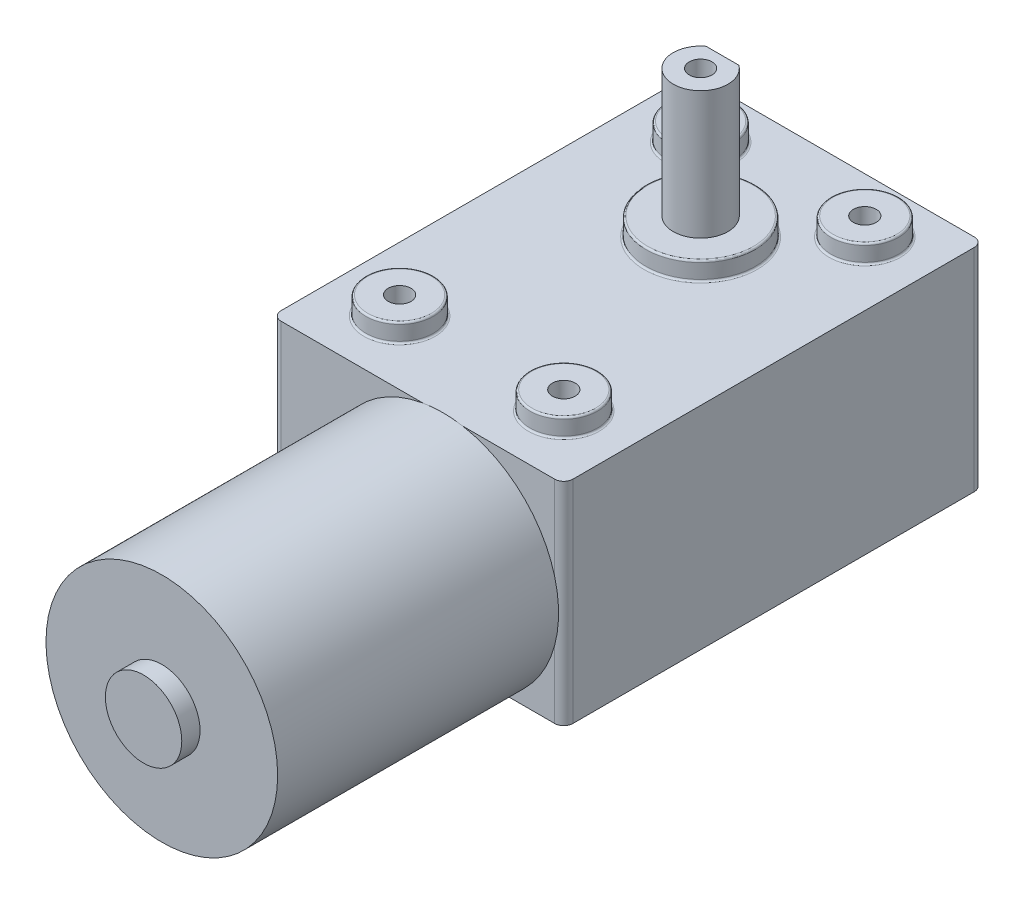
ISO-10303-21;
HEADER;
FILE_DESCRIPTION(('STEP AP214'),'2;1');
FILE_NAME('part.step','',(''),(''),'','','');
FILE_SCHEMA(('AUTOMOTIVE_DESIGN { 1 0 10303 214 1 1 1 1 }'));
ENDSEC;
DATA;
#1=APPLICATION_CONTEXT('core data for automotive mechanical design processes');
#2=APPLICATION_PROTOCOL_DEFINITION('international standard','automotive_design',2000,#1);
#3=PRODUCT_CONTEXT('',#1,'mechanical');
#4=PRODUCT('Part','Part','',(#3));
#5=PRODUCT_RELATED_PRODUCT_CATEGORY('part','',(#4));
#6=PRODUCT_DEFINITION_FORMATION('','',#4);
#7=PRODUCT_DEFINITION_CONTEXT('part definition',#1,'design');
#8=PRODUCT_DEFINITION('design','',#6,#7);
#9=PRODUCT_DEFINITION_SHAPE('','',#8);
#10=(LENGTH_UNIT() NAMED_UNIT(*) SI_UNIT(.MILLI.,.METRE.));
#11=(NAMED_UNIT(*) PLANE_ANGLE_UNIT() SI_UNIT($,.RADIAN.));
#12=(NAMED_UNIT(*) SI_UNIT($,.STERADIAN.) SOLID_ANGLE_UNIT());
#13=UNCERTAINTY_MEASURE_WITH_UNIT(LENGTH_MEASURE(1.E-05),#10,'distance_accuracy_value','');
#14=(GEOMETRIC_REPRESENTATION_CONTEXT(3) GLOBAL_UNCERTAINTY_ASSIGNED_CONTEXT((#13)) GLOBAL_UNIT_ASSIGNED_CONTEXT((#10,
#11,#12)) REPRESENTATION_CONTEXT('',''));
#15=CARTESIAN_POINT('',(0.,0.,0.));
#16=DIRECTION('',(0.,0.,1.));
#17=DIRECTION('',(1.,0.,0.));
#18=AXIS2_PLACEMENT_3D('',#15,#16,#17);
#19=CARTESIAN_POINT('',(0.,23.2,0.));
#20=DIRECTION('',(0.,0.,-1.));
#21=DIRECTION('',(-1.,0.,0.));
#22=AXIS2_PLACEMENT_3D('',#19,#20,#21);
#23=PLANE('',#22);
#24=CARTESIAN_POINT('',(18.7297984360643,10.6881933027604,0.));
#25=DIRECTION('',(0.,0.,1.));
#26=DIRECTION('',(1.,0.,0.));
#27=AXIS2_PLACEMENT_3D('',#24,#25,#26);
#28=CIRCLE('',#27,12.7);
#29=CARTESIAN_POINT('',(25.5892826676103,0.,0.));
#30=VERTEX_POINT('',#29);
#31=CARTESIAN_POINT('',(31.,7.41219672455852,0.));
#32=VERTEX_POINT('',#31);
#33=EDGE_CURVE('E176',#30,#32,#28,.T.);
#34=ORIENTED_EDGE('',*,*,#33,.F.);
#35=DIRECTION('',(1.,0.,0.));
#36=VECTOR('',#35,1.);
#37=CARTESIAN_POINT('',(0.,0.,0.));
#38=LINE('',#37,#36);
#39=CARTESIAN_POINT('',(31.,0.,0.));
#40=VERTEX_POINT('',#39);
#41=EDGE_CURVE('E252',#30,#40,#38,.T.);
#42=ORIENTED_EDGE('',*,*,#41,.T.);
#43=DIRECTION('',(0.,-1.,0.));
#44=VECTOR('',#43,1.);
#45=CARTESIAN_POINT('',(31.,23.2,0.));
#46=LINE('',#45,#44);
#47=EDGE_CURVE('E159',#40,#32,#46,.F.);
#48=ORIENTED_EDGE('',*,*,#47,.T.);
#49=EDGE_LOOP('',(#34,#42,#48));
#50=FACE_BOUND('',#49,.T.);
#51=ADVANCED_FACE('F36',(#50),#23,.F.);
#52=CARTESIAN_POINT('',(31.,13.9641898809622,0.));
#53=VERTEX_POINT('',#52);
#54=CARTESIAN_POINT('',(20.9080300975067,23.2,0.));
#55=VERTEX_POINT('',#54);
#56=EDGE_CURVE('E161',#53,#55,#28,.T.);
#57=ORIENTED_EDGE('',*,*,#56,.F.);
#58=CARTESIAN_POINT('',(31.,23.2,0.));
#59=VERTEX_POINT('',#58);
#60=EDGE_CURVE('E149',#53,#59,#46,.F.);
#61=ORIENTED_EDGE('',*,*,#60,.T.);
#62=DIRECTION('',(1.,0.,0.));
#63=VECTOR('',#62,1.);
#64=CARTESIAN_POINT('',(0.,23.2,0.));
#65=LINE('',#64,#63);
#66=EDGE_CURVE('E52',#55,#59,#65,.T.);
#67=ORIENTED_EDGE('',*,*,#66,.F.);
#68=EDGE_LOOP('',(#57,#61,#67));
#69=FACE_BOUND('',#68,.T.);
#70=ADVANCED_FACE('F162',(#69),#23,.F.);
#71=CARTESIAN_POINT('',(0.,23.2,0.));
#72=DIRECTION('',(1.,0.,0.));
#73=DIRECTION('',(0.,0.,-1.));
#74=AXIS2_PLACEMENT_3D('',#71,#72,#73);
#75=PLANE('',#74);
#76=DIRECTION('',(0.,0.,1.));
#77=VECTOR('',#76,1.);
#78=CARTESIAN_POINT('',(0.,23.2,0.));
#79=LINE('',#78,#77);
#80=CARTESIAN_POINT('',(0.,23.2,-45.));
#81=VERTEX_POINT('',#80);
#82=CARTESIAN_POINT('',(0.,23.2,-1.));
#83=VERTEX_POINT('',#82);
#84=EDGE_CURVE('E239',#81,#83,#79,.T.);
#85=ORIENTED_EDGE('',*,*,#84,.F.);
#86=DIRECTION('',(0.,-1.,0.));
#87=VECTOR('',#86,1.);
#88=CARTESIAN_POINT('',(0.,23.2,-45.));
#89=LINE('',#88,#87);
#90=CARTESIAN_POINT('',(0.,0.,-45.));
#91=VERTEX_POINT('',#90);
#92=EDGE_CURVE('E261',#81,#91,#89,.T.);
#93=ORIENTED_EDGE('',*,*,#92,.T.);
#94=DIRECTION('',(0.,0.,1.));
#95=VECTOR('',#94,1.);
#96=CARTESIAN_POINT('',(0.,0.,0.));
#97=LINE('',#96,#95);
#98=CARTESIAN_POINT('',(0.,0.,-1.));
#99=VERTEX_POINT('',#98);
#100=EDGE_CURVE('E233',#91,#99,#97,.T.);
#101=ORIENTED_EDGE('',*,*,#100,.T.);
#102=DIRECTION('',(0.,-1.,0.));
#103=VECTOR('',#102,1.);
#104=CARTESIAN_POINT('',(0.,23.2,-1.));
#105=LINE('',#104,#103);
#106=EDGE_CURVE('E237',#99,#83,#105,.F.);
#107=ORIENTED_EDGE('',*,*,#106,.T.);
#108=EDGE_LOOP('',(#85,#93,#101,#107));
#109=FACE_BOUND('',#108,.T.);
#110=ADVANCED_FACE('F393',(#109),#75,.F.);
#111=CARTESIAN_POINT('',(16.5515667746219,23.2,0.));
#112=VERTEX_POINT('',#111);
#113=CARTESIAN_POINT('',(11.8703142045183,0.,0.));
#114=VERTEX_POINT('',#113);
#115=EDGE_CURVE('E60',#112,#114,#28,.T.);
#116=ORIENTED_EDGE('',*,*,#115,.F.);
#117=CARTESIAN_POINT('',(1.,23.2,0.));
#118=VERTEX_POINT('',#117);
#119=EDGE_CURVE('E243',#118,#112,#65,.T.);
#120=ORIENTED_EDGE('',*,*,#119,.F.);
#121=DIRECTION('',(0.,-1.,0.));
#122=VECTOR('',#121,1.);
#123=CARTESIAN_POINT('',(1.,23.2,0.));
#124=LINE('',#123,#122);
#125=CARTESIAN_POINT('',(1.,0.,0.));
#126=VERTEX_POINT('',#125);
#127=EDGE_CURVE('E284',#118,#126,#124,.T.);
#128=ORIENTED_EDGE('',*,*,#127,.T.);
#129=EDGE_CURVE('E253',#126,#114,#38,.T.);
#130=ORIENTED_EDGE('',*,*,#129,.T.);
#131=EDGE_LOOP('',(#116,#120,#128,#130));
#132=FACE_BOUND('',#131,.T.);
#133=ADVANCED_FACE('F389',(#132),#23,.F.);
#134=CARTESIAN_POINT('',(32.,23.2,0.));
#135=DIRECTION('',(-1.,0.,0.));
#136=DIRECTION('',(0.,0.,1.));
#137=AXIS2_PLACEMENT_3D('',#134,#135,#136);
#138=PLANE('',#137);
#139=DIRECTION('',(0.,0.,-1.));
#140=VECTOR('',#139,1.);
#141=CARTESIAN_POINT('',(32.,0.,0.));
#142=LINE('',#141,#140);
#143=CARTESIAN_POINT('',(32.,0.,-1.));
#144=VERTEX_POINT('',#143);
#145=CARTESIAN_POINT('',(32.,0.,-45.));
#146=VERTEX_POINT('',#145);
#147=EDGE_CURVE('E255',#144,#146,#142,.T.);
#148=ORIENTED_EDGE('',*,*,#147,.T.);
#149=DIRECTION('',(0.,-1.,0.));
#150=VECTOR('',#149,1.);
#151=CARTESIAN_POINT('',(32.,23.2,-45.));
#152=LINE('',#151,#150);
#153=CARTESIAN_POINT('',(32.,23.2,-45.));
#154=VERTEX_POINT('',#153);
#155=EDGE_CURVE('E290',#146,#154,#152,.F.);
#156=ORIENTED_EDGE('',*,*,#155,.T.);
#157=DIRECTION('',(0.,0.,-1.));
#158=VECTOR('',#157,1.);
#159=CARTESIAN_POINT('',(32.,23.2,0.));
#160=LINE('',#159,#158);
#161=CARTESIAN_POINT('',(32.,23.2,-1.));
#162=VERTEX_POINT('',#161);
#163=EDGE_CURVE('E245',#162,#154,#160,.T.);
#164=ORIENTED_EDGE('',*,*,#163,.F.);
#165=DIRECTION('',(0.,-1.,0.));
#166=VECTOR('',#165,1.);
#167=CARTESIAN_POINT('',(32.,23.2,-1.));
#168=LINE('',#167,#166);
#169=EDGE_CURVE('E287',#162,#144,#168,.T.);
#170=ORIENTED_EDGE('',*,*,#169,.T.);
#171=EDGE_LOOP('',(#148,#156,#164,#170));
#172=FACE_BOUND('',#171,.T.);
#173=ADVANCED_FACE('F397',(#172),#138,.F.);
#174=CARTESIAN_POINT('',(0.,23.2,-46.));
#175=DIRECTION('',(0.,0.,1.));
#176=DIRECTION('',(1.,0.,0.));
#177=AXIS2_PLACEMENT_3D('',#174,#175,#176);
#178=PLANE('',#177);
#179=DIRECTION('',(-1.,0.,0.));
#180=VECTOR('',#179,1.);
#181=CARTESIAN_POINT('',(0.,0.,-46.));
#182=LINE('',#181,#180);
#183=CARTESIAN_POINT('',(31.,0.,-46.));
#184=VERTEX_POINT('',#183);
#185=CARTESIAN_POINT('',(1.,0.,-46.));
#186=VERTEX_POINT('',#185);
#187=EDGE_CURVE('E242',#184,#186,#182,.T.);
#188=ORIENTED_EDGE('',*,*,#187,.T.);
#189=DIRECTION('',(0.,-1.,0.));
#190=VECTOR('',#189,1.);
#191=CARTESIAN_POINT('',(1.,23.2,-46.));
#192=LINE('',#191,#190);
#193=CARTESIAN_POINT('',(1.,23.2,-46.));
#194=VERTEX_POINT('',#193);
#195=EDGE_CURVE('E276',#186,#194,#192,.F.);
#196=ORIENTED_EDGE('',*,*,#195,.T.);
#197=DIRECTION('',(-1.,0.,0.));
#198=VECTOR('',#197,1.);
#199=CARTESIAN_POINT('',(0.,23.2,-46.));
#200=LINE('',#199,#198);
#201=CARTESIAN_POINT('',(31.,23.2,-46.));
#202=VERTEX_POINT('',#201);
#203=EDGE_CURVE('E238',#202,#194,#200,.T.);
#204=ORIENTED_EDGE('',*,*,#203,.F.);
#205=DIRECTION('',(0.,-1.,0.));
#206=VECTOR('',#205,1.);
#207=CARTESIAN_POINT('',(31.,23.2,-46.));
#208=LINE('',#207,#206);
#209=EDGE_CURVE('E273',#202,#184,#208,.T.);
#210=ORIENTED_EDGE('',*,*,#209,.T.);
#211=EDGE_LOOP('',(#188,#196,#204,#210));
#212=FACE_BOUND('',#211,.T.);
#213=ADVANCED_FACE('F402',(#212),#178,.F.);
#214=CARTESIAN_POINT('',(0.,23.2,0.));
#215=DIRECTION('',(0.,-1.,0.));
#216=DIRECTION('',(0.,0.,-1.));
#217=AXIS2_PLACEMENT_3D('',#214,#215,#216);
#218=PLANE('',#217);
#219=CARTESIAN_POINT('',(16.,23.2,-31.));
#220=DIRECTION('',(0.,-1.,0.));
#221=DIRECTION('',(0.,0.,-1.));
#222=AXIS2_PLACEMENT_3D('',#219,#220,#221);
#223=CIRCLE('',#222,6.2);
#224=CARTESIAN_POINT('',(16.,23.2,-37.2));
#225=VERTEX_POINT('',#224);
#226=EDGE_CURVE('E313',#225,#225,#223,.T.);
#227=ORIENTED_EDGE('',*,*,#226,.T.);
#228=EDGE_LOOP('',(#227));
#229=FACE_BOUND('',#228,.T.);
#230=CARTESIAN_POINT('',(7.,23.2,-40.));
#231=DIRECTION('',(0.,-1.,0.));
#232=DIRECTION('',(0.,0.,-1.));
#233=AXIS2_PLACEMENT_3D('',#230,#231,#232);
#234=CIRCLE('',#233,3.9);
#235=CARTESIAN_POINT('',(7.,23.2,-43.9));
#236=VERTEX_POINT('',#235);
#237=EDGE_CURVE('E310',#236,#236,#234,.T.);
#238=ORIENTED_EDGE('',*,*,#237,.T.);
#239=EDGE_LOOP('',(#238));
#240=FACE_BOUND('',#239,.T.);
#241=CARTESIAN_POINT('',(25.,23.2,-40.));
#242=DIRECTION('',(0.,-1.,0.));
#243=DIRECTION('',(0.,0.,-1.));
#244=AXIS2_PLACEMENT_3D('',#241,#242,#243);
#245=CIRCLE('',#244,3.9);
#246=CARTESIAN_POINT('',(25.,23.2,-43.9));
#247=VERTEX_POINT('',#246);
#248=EDGE_CURVE('E307',#247,#247,#245,.T.);
#249=ORIENTED_EDGE('',*,*,#248,.T.);
#250=EDGE_LOOP('',(#249));
#251=FACE_BOUND('',#250,.T.);
#252=CARTESIAN_POINT('',(7.00000000000001,23.2,-7.));
#253=DIRECTION('',(0.,-1.,0.));
#254=DIRECTION('',(0.,0.,-1.));
#255=AXIS2_PLACEMENT_3D('',#252,#253,#254);
#256=CIRCLE('',#255,3.9);
#257=CARTESIAN_POINT('',(7.00000000000001,23.2,-10.9));
#258=VERTEX_POINT('',#257);
#259=EDGE_CURVE('E304',#258,#258,#256,.T.);
#260=ORIENTED_EDGE('',*,*,#259,.T.);
#261=EDGE_LOOP('',(#260));
#262=FACE_BOUND('',#261,.T.);
#263=CARTESIAN_POINT('',(25.,23.2,-7.));
#264=DIRECTION('',(0.,-1.,0.));
#265=DIRECTION('',(0.,0.,-1.));
#266=AXIS2_PLACEMENT_3D('',#263,#264,#265);
#267=CIRCLE('',#266,3.9);
#268=CARTESIAN_POINT('',(25.,23.2,-10.9));
#269=VERTEX_POINT('',#268);
#270=EDGE_CURVE('E301',#269,#269,#267,.T.);
#271=ORIENTED_EDGE('',*,*,#270,.T.);
#272=EDGE_LOOP('',(#271));
#273=FACE_BOUND('',#272,.T.);
#274=ORIENTED_EDGE('',*,*,#203,.T.);
#275=CARTESIAN_POINT('',(1.,23.2,-45.));
#276=DIRECTION('',(0.,-1.,0.));
#277=DIRECTION('',(0.,0.,-1.));
#278=AXIS2_PLACEMENT_3D('',#275,#276,#277);
#279=CIRCLE('',#278,1.);
#280=EDGE_CURVE('E157',#194,#81,#279,.F.);
#281=ORIENTED_EDGE('',*,*,#280,.T.);
#282=ORIENTED_EDGE('',*,*,#84,.T.);
#283=CARTESIAN_POINT('',(1.,23.2,-1.));
#284=DIRECTION('',(0.,-1.,0.));
#285=DIRECTION('',(0.,0.,-1.));
#286=AXIS2_PLACEMENT_3D('',#283,#284,#285);
#287=CIRCLE('',#286,1.);
#288=EDGE_CURVE('E281',#83,#118,#287,.F.);
#289=ORIENTED_EDGE('',*,*,#288,.T.);
#290=ORIENTED_EDGE('',*,*,#119,.T.);
#291=DIRECTION('',(-1.,0.,0.));
#292=VECTOR('',#291,1.);
#293=CARTESIAN_POINT('',(0.,23.2,0.));
#294=LINE('',#293,#292);
#295=EDGE_CURVE('E185',#55,#112,#294,.T.);
#296=ORIENTED_EDGE('',*,*,#295,.F.);
#297=ORIENTED_EDGE('',*,*,#66,.T.);
#298=CARTESIAN_POINT('',(31.,23.2,-1.));
#299=DIRECTION('',(0.,-1.,0.));
#300=DIRECTION('',(0.,0.,-1.));
#301=AXIS2_PLACEMENT_3D('',#298,#299,#300);
#302=CIRCLE('',#301,1.);
#303=EDGE_CURVE('E156',#59,#162,#302,.F.);
#304=ORIENTED_EDGE('',*,*,#303,.T.);
#305=ORIENTED_EDGE('',*,*,#163,.T.);
#306=CARTESIAN_POINT('',(31.,23.2,-45.));
#307=DIRECTION('',(0.,-1.,0.));
#308=DIRECTION('',(0.,0.,-1.));
#309=AXIS2_PLACEMENT_3D('',#306,#307,#308);
#310=CIRCLE('',#309,1.);
#311=EDGE_CURVE('E279',#154,#202,#310,.F.);
#312=ORIENTED_EDGE('',*,*,#311,.T.);
#313=EDGE_LOOP('',(#274,#281,#282,#289,#290,#296,#297,#304,#305,#312));
#314=FACE_BOUND('',#313,.T.);
#315=ADVANCED_FACE('F459',(#229,#240,#251,#262,#273,#314),#218,.F.);
#316=CARTESIAN_POINT('',(0.,0.,0.));
#317=DIRECTION('',(0.,-1.,0.));
#318=DIRECTION('',(0.,0.,-1.));
#319=AXIS2_PLACEMENT_3D('',#316,#317,#318);
#320=PLANE('',#319);
#321=ORIENTED_EDGE('',*,*,#100,.F.);
#322=CARTESIAN_POINT('',(1.,0.,-45.));
#323=DIRECTION('',(0.,-1.,0.));
#324=DIRECTION('',(0.,0.,-1.));
#325=AXIS2_PLACEMENT_3D('',#322,#323,#324);
#326=CIRCLE('',#325,1.);
#327=EDGE_CURVE('E271',#91,#186,#326,.T.);
#328=ORIENTED_EDGE('',*,*,#327,.T.);
#329=ORIENTED_EDGE('',*,*,#187,.F.);
#330=CARTESIAN_POINT('',(31.,0.,-45.));
#331=DIRECTION('',(0.,-1.,0.));
#332=DIRECTION('',(0.,0.,-1.));
#333=AXIS2_PLACEMENT_3D('',#330,#331,#332);
#334=CIRCLE('',#333,1.);
#335=EDGE_CURVE('E267',#184,#146,#334,.T.);
#336=ORIENTED_EDGE('',*,*,#335,.T.);
#337=ORIENTED_EDGE('',*,*,#147,.F.);
#338=CARTESIAN_POINT('',(31.,0.,-1.));
#339=DIRECTION('',(0.,-1.,0.));
#340=DIRECTION('',(0.,0.,-1.));
#341=AXIS2_PLACEMENT_3D('',#338,#339,#340);
#342=CIRCLE('',#341,1.);
#343=EDGE_CURVE('E264',#144,#40,#342,.T.);
#344=ORIENTED_EDGE('',*,*,#343,.T.);
#345=ORIENTED_EDGE('',*,*,#41,.F.);
#346=DIRECTION('',(-1.,0.,0.));
#347=VECTOR('',#346,1.);
#348=CARTESIAN_POINT('',(0.,0.,0.));
#349=LINE('',#348,#347);
#350=EDGE_CURVE('E183',#30,#114,#349,.T.);
#351=ORIENTED_EDGE('',*,*,#350,.T.);
#352=ORIENTED_EDGE('',*,*,#129,.F.);
#353=CARTESIAN_POINT('',(1.,0.,-1.));
#354=DIRECTION('',(0.,-1.,0.));
#355=DIRECTION('',(0.,0.,-1.));
#356=AXIS2_PLACEMENT_3D('',#353,#354,#355);
#357=CIRCLE('',#356,1.);
#358=EDGE_CURVE('E269',#126,#99,#357,.T.);
#359=ORIENTED_EDGE('',*,*,#358,.T.);
#360=EDGE_LOOP('',(#321,#328,#329,#336,#337,#344,#345,#351,#352,#359));
#361=FACE_BOUND('',#360,.T.);
#362=ADVANCED_FACE('F462',(#361),#320,.T.);
#363=CARTESIAN_POINT('',(7.,25.2,-40.));
#364=DIRECTION('',(0.,-1.,0.));
#365=DIRECTION('',(0.,0.,-1.));
#366=AXIS2_PLACEMENT_3D('',#363,#364,#365);
#367=CYLINDRICAL_SURFACE('',#366,3.7);
#368=CARTESIAN_POINT('',(7.,25.,-40.));
#369=DIRECTION('',(0.,1.,0.));
#370=DIRECTION('',(0.,0.,1.));
#371=AXIS2_PLACEMENT_3D('',#368,#369,#370);
#372=CIRCLE('',#371,3.7);
#373=CARTESIAN_POINT('',(7.,25.,-36.3));
#374=VERTEX_POINT('',#373);
#375=EDGE_CURVE('E322',#374,#374,#372,.F.);
#376=ORIENTED_EDGE('',*,*,#375,.T.);
#377=EDGE_LOOP('',(#376));
#378=FACE_BOUND('',#377,.T.);
#379=CARTESIAN_POINT('',(7.,23.4,-40.));
#380=DIRECTION('',(0.,-1.,0.));
#381=DIRECTION('',(0.,0.,-1.));
#382=AXIS2_PLACEMENT_3D('',#379,#380,#381);
#383=CIRCLE('',#382,3.7);
#384=CARTESIAN_POINT('',(7.,23.4,-43.7));
#385=VERTEX_POINT('',#384);
#386=EDGE_CURVE('E319',#385,#385,#383,.F.);
#387=ORIENTED_EDGE('',*,*,#386,.T.);
#388=EDGE_LOOP('',(#387));
#389=FACE_BOUND('',#388,.T.);
#390=ADVANCED_FACE('F497',(#378,#389),#367,.T.);
#391=CARTESIAN_POINT('',(7.,25.2,-40.));
#392=DIRECTION('',(0.,1.,0.));
#393=DIRECTION('',(0.,0.,1.));
#394=AXIS2_PLACEMENT_3D('',#391,#392,#393);
#395=PLANE('',#394);
#396=CARTESIAN_POINT('',(7.,25.2,-40.));
#397=DIRECTION('',(0.,1.,0.));
#398=DIRECTION('',(0.,0.,1.));
#399=AXIS2_PLACEMENT_3D('',#396,#397,#398);
#400=CIRCLE('',#399,3.5);
#401=CARTESIAN_POINT('',(7.,25.2,-36.5));
#402=VERTEX_POINT('',#401);
#403=EDGE_CURVE('E316',#402,#402,#400,.T.);
#404=ORIENTED_EDGE('',*,*,#403,.T.);
#405=EDGE_LOOP('',(#404));
#406=FACE_BOUND('',#405,.T.);
#407=CARTESIAN_POINT('',(7.,25.2,-40.));
#408=DIRECTION('',(0.,1.,0.));
#409=DIRECTION('',(0.,0.,1.));
#410=AXIS2_PLACEMENT_3D('',#407,#408,#409);
#411=CIRCLE('',#410,1.24999999999999);
#412=CARTESIAN_POINT('',(7.,25.2,-38.75));
#413=VERTEX_POINT('',#412);
#414=EDGE_CURVE('E200',#413,#413,#411,.T.);
#415=ORIENTED_EDGE('',*,*,#414,.F.);
#416=EDGE_LOOP('',(#415));
#417=FACE_BOUND('',#416,.T.);
#418=ADVANCED_FACE('F501',(#406,#417),#395,.T.);
#419=CARTESIAN_POINT('',(25.,25.2,-40.));
#420=DIRECTION('',(0.,-1.,0.));
#421=DIRECTION('',(0.,0.,-1.));
#422=AXIS2_PLACEMENT_3D('',#419,#420,#421);
#423=CYLINDRICAL_SURFACE('',#422,3.7);
#424=CARTESIAN_POINT('',(25.,25.,-40.));
#425=DIRECTION('',(0.,1.,0.));
#426=DIRECTION('',(0.,0.,1.));
#427=AXIS2_PLACEMENT_3D('',#424,#425,#426);
#428=CIRCLE('',#427,3.7);
#429=CARTESIAN_POINT('',(25.,25.,-36.3));
#430=VERTEX_POINT('',#429);
#431=EDGE_CURVE('E331',#430,#430,#428,.F.);
#432=ORIENTED_EDGE('',*,*,#431,.T.);
#433=EDGE_LOOP('',(#432));
#434=FACE_BOUND('',#433,.T.);
#435=CARTESIAN_POINT('',(25.,23.4,-40.));
#436=DIRECTION('',(0.,-1.,0.));
#437=DIRECTION('',(0.,0.,-1.));
#438=AXIS2_PLACEMENT_3D('',#435,#436,#437);
#439=CIRCLE('',#438,3.7);
#440=CARTESIAN_POINT('',(25.,23.4,-43.7));
#441=VERTEX_POINT('',#440);
#442=EDGE_CURVE('E328',#441,#441,#439,.F.);
#443=ORIENTED_EDGE('',*,*,#442,.T.);
#444=EDGE_LOOP('',(#443));
#445=FACE_BOUND('',#444,.T.);
#446=ADVANCED_FACE('F505',(#434,#445),#423,.T.);
#447=CARTESIAN_POINT('',(25.,25.2,-40.));
#448=DIRECTION('',(0.,1.,0.));
#449=DIRECTION('',(0.,0.,1.));
#450=AXIS2_PLACEMENT_3D('',#447,#448,#449);
#451=PLANE('',#450);
#452=CARTESIAN_POINT('',(25.,25.2,-40.));
#453=DIRECTION('',(0.,1.,0.));
#454=DIRECTION('',(0.,0.,1.));
#455=AXIS2_PLACEMENT_3D('',#452,#453,#454);
#456=CIRCLE('',#455,3.5);
#457=CARTESIAN_POINT('',(25.,25.2,-36.5));
#458=VERTEX_POINT('',#457);
#459=EDGE_CURVE('E325',#458,#458,#456,.T.);
#460=ORIENTED_EDGE('',*,*,#459,.T.);
#461=EDGE_LOOP('',(#460));
#462=FACE_BOUND('',#461,.T.);
#463=CARTESIAN_POINT('',(25.,25.2,-40.));
#464=DIRECTION('',(0.,1.,0.));
#465=DIRECTION('',(0.,0.,1.));
#466=AXIS2_PLACEMENT_3D('',#463,#464,#465);
#467=CIRCLE('',#466,1.24999999999999);
#468=CARTESIAN_POINT('',(25.,25.2,-38.75));
#469=VERTEX_POINT('',#468);
#470=EDGE_CURVE('E206',#469,#469,#467,.T.);
#471=ORIENTED_EDGE('',*,*,#470,.F.);
#472=EDGE_LOOP('',(#471));
#473=FACE_BOUND('',#472,.T.);
#474=ADVANCED_FACE('F509',(#462,#473),#451,.T.);
#475=CARTESIAN_POINT('',(7.00000000000001,25.2,-7.));
#476=DIRECTION('',(0.,-1.,0.));
#477=DIRECTION('',(0.,0.,-1.));
#478=AXIS2_PLACEMENT_3D('',#475,#476,#477);
#479=CYLINDRICAL_SURFACE('',#478,3.7);
#480=CARTESIAN_POINT('',(7.00000000000001,25.,-7.));
#481=DIRECTION('',(0.,1.,0.));
#482=DIRECTION('',(0.,0.,1.));
#483=AXIS2_PLACEMENT_3D('',#480,#481,#482);
#484=CIRCLE('',#483,3.7);
#485=CARTESIAN_POINT('',(7.00000000000001,25.,-3.3));
#486=VERTEX_POINT('',#485);
#487=EDGE_CURVE('E40',#486,#486,#484,.F.);
#488=ORIENTED_EDGE('',*,*,#487,.T.);
#489=EDGE_LOOP('',(#488));
#490=FACE_BOUND('',#489,.T.);
#491=CARTESIAN_POINT('',(7.00000000000001,23.4,-7.));
#492=DIRECTION('',(0.,-1.,0.));
#493=DIRECTION('',(0.,0.,-1.));
#494=AXIS2_PLACEMENT_3D('',#491,#492,#493);
#495=CIRCLE('',#494,3.7);
#496=CARTESIAN_POINT('',(7.00000000000001,23.4,-10.7));
#497=VERTEX_POINT('',#496);
#498=EDGE_CURVE('E345',#497,#497,#495,.F.);
#499=ORIENTED_EDGE('',*,*,#498,.T.);
#500=EDGE_LOOP('',(#499));
#501=FACE_BOUND('',#500,.T.);
#502=ADVANCED_FACE('F352',(#490,#501),#479,.T.);
#503=CARTESIAN_POINT('',(7.00000000000001,25.2,-7.));
#504=DIRECTION('',(0.,1.,0.));
#505=DIRECTION('',(0.,0.,1.));
#506=AXIS2_PLACEMENT_3D('',#503,#504,#505);
#507=PLANE('',#506);
#508=CARTESIAN_POINT('',(7.00000000000001,25.2,-7.));
#509=DIRECTION('',(0.,1.,0.));
#510=DIRECTION('',(0.,0.,1.));
#511=AXIS2_PLACEMENT_3D('',#508,#509,#510);
#512=CIRCLE('',#511,3.5);
#513=CARTESIAN_POINT('',(7.00000000000001,25.2,-3.5));
#514=VERTEX_POINT('',#513);
#515=EDGE_CURVE('E343',#514,#514,#512,.T.);
#516=ORIENTED_EDGE('',*,*,#515,.T.);
#517=EDGE_LOOP('',(#516));
#518=FACE_BOUND('',#517,.T.);
#519=CARTESIAN_POINT('',(7.00000000000001,25.2,-7.));
#520=DIRECTION('',(0.,1.,0.));
#521=DIRECTION('',(0.,0.,1.));
#522=AXIS2_PLACEMENT_3D('',#519,#520,#521);
#523=CIRCLE('',#522,1.24999999999999);
#524=CARTESIAN_POINT('',(7.00000000000001,25.2,-5.75000000000001));
#525=VERTEX_POINT('',#524);
#526=EDGE_CURVE('E194',#525,#525,#523,.T.);
#527=ORIENTED_EDGE('',*,*,#526,.F.);
#528=EDGE_LOOP('',(#527));
#529=FACE_BOUND('',#528,.T.);
#530=ADVANCED_FACE('F362',(#518,#529),#507,.T.);
#531=CARTESIAN_POINT('',(25.,25.2,-7.));
#532=DIRECTION('',(0.,-1.,0.));
#533=DIRECTION('',(0.,0.,-1.));
#534=AXIS2_PLACEMENT_3D('',#531,#532,#533);
#535=CYLINDRICAL_SURFACE('',#534,3.7);
#536=CARTESIAN_POINT('',(25.,25.,-7.));
#537=DIRECTION('',(0.,1.,0.));
#538=DIRECTION('',(0.,0.,1.));
#539=AXIS2_PLACEMENT_3D('',#536,#537,#538);
#540=CIRCLE('',#539,3.7);
#541=CARTESIAN_POINT('',(25.,25.,-3.3));
#542=VERTEX_POINT('',#541);
#543=EDGE_CURVE('E340',#542,#542,#540,.F.);
#544=ORIENTED_EDGE('',*,*,#543,.T.);
#545=EDGE_LOOP('',(#544));
#546=FACE_BOUND('',#545,.T.);
#547=CARTESIAN_POINT('',(25.,23.4,-7.));
#548=DIRECTION('',(0.,-1.,0.));
#549=DIRECTION('',(0.,0.,-1.));
#550=AXIS2_PLACEMENT_3D('',#547,#548,#549);
#551=CIRCLE('',#550,3.7);
#552=CARTESIAN_POINT('',(25.,23.4,-10.7));
#553=VERTEX_POINT('',#552);
#554=EDGE_CURVE('E337',#553,#553,#551,.F.);
#555=ORIENTED_EDGE('',*,*,#554,.T.);
#556=EDGE_LOOP('',(#555));
#557=FACE_BOUND('',#556,.T.);
#558=ADVANCED_FACE('F365',(#546,#557),#535,.T.);
#559=CARTESIAN_POINT('',(25.,25.2,-7.));
#560=DIRECTION('',(0.,1.,0.));
#561=DIRECTION('',(0.,0.,1.));
#562=AXIS2_PLACEMENT_3D('',#559,#560,#561);
#563=PLANE('',#562);
#564=CARTESIAN_POINT('',(25.,25.2,-7.));
#565=DIRECTION('',(0.,1.,0.));
#566=DIRECTION('',(0.,0.,1.));
#567=AXIS2_PLACEMENT_3D('',#564,#565,#566);
#568=CIRCLE('',#567,3.5);
#569=CARTESIAN_POINT('',(25.,25.2,-3.5));
#570=VERTEX_POINT('',#569);
#571=EDGE_CURVE('E334',#570,#570,#568,.T.);
#572=ORIENTED_EDGE('',*,*,#571,.T.);
#573=EDGE_LOOP('',(#572));
#574=FACE_BOUND('',#573,.T.);
#575=CARTESIAN_POINT('',(25.,25.2,-7.));
#576=DIRECTION('',(0.,1.,0.));
#577=DIRECTION('',(0.,0.,1.));
#578=AXIS2_PLACEMENT_3D('',#575,#576,#577);
#579=CIRCLE('',#578,1.24999999999999);
#580=CARTESIAN_POINT('',(25.,25.2,-5.75000000000001));
#581=VERTEX_POINT('',#580);
#582=EDGE_CURVE('E188',#581,#581,#579,.T.);
#583=ORIENTED_EDGE('',*,*,#582,.F.);
#584=EDGE_LOOP('',(#583));
#585=FACE_BOUND('',#584,.T.);
#586=ADVANCED_FACE('F518',(#574,#585),#563,.T.);
#587=CARTESIAN_POINT('',(16.,25.2,-31.));
#588=DIRECTION('',(0.,-1.,0.));
#589=DIRECTION('',(0.,0.,-1.));
#590=AXIS2_PLACEMENT_3D('',#587,#588,#589);
#591=CYLINDRICAL_SURFACE('',#590,6.);
#592=CARTESIAN_POINT('',(16.,25.,-31.));
#593=DIRECTION('',(0.,1.,0.));
#594=DIRECTION('',(0.,0.,1.));
#595=AXIS2_PLACEMENT_3D('',#592,#593,#594);
#596=CIRCLE('',#595,6.);
#597=CARTESIAN_POINT('',(16.,25.,-25.));
#598=VERTEX_POINT('',#597);
#599=EDGE_CURVE('E298',#598,#598,#596,.F.);
#600=ORIENTED_EDGE('',*,*,#599,.T.);
#601=EDGE_LOOP('',(#600));
#602=FACE_BOUND('',#601,.T.);
#603=CARTESIAN_POINT('',(16.,23.4,-31.));
#604=DIRECTION('',(0.,-1.,0.));
#605=DIRECTION('',(0.,0.,-1.));
#606=AXIS2_PLACEMENT_3D('',#603,#604,#605);
#607=CIRCLE('',#606,6.);
#608=CARTESIAN_POINT('',(16.,23.4,-37.));
#609=VERTEX_POINT('',#608);
#610=EDGE_CURVE('E295',#609,#609,#607,.F.);
#611=ORIENTED_EDGE('',*,*,#610,.T.);
#612=EDGE_LOOP('',(#611));
#613=FACE_BOUND('',#612,.T.);
#614=ADVANCED_FACE('F522',(#602,#613),#591,.T.);
#615=CARTESIAN_POINT('',(16.,25.2,-31.));
#616=DIRECTION('',(0.,1.,0.));
#617=DIRECTION('',(0.,0.,1.));
#618=AXIS2_PLACEMENT_3D('',#615,#616,#617);
#619=PLANE('',#618);
#620=CARTESIAN_POINT('',(16.,25.2,-31.));
#621=DIRECTION('',(0.,1.,0.));
#622=DIRECTION('',(0.,0.,1.));
#623=AXIS2_PLACEMENT_3D('',#620,#621,#622);
#624=CIRCLE('',#623,5.8);
#625=CARTESIAN_POINT('',(16.,25.2,-25.2));
#626=VERTEX_POINT('',#625);
#627=EDGE_CURVE('E292',#626,#626,#624,.T.);
#628=ORIENTED_EDGE('',*,*,#627,.T.);
#629=EDGE_LOOP('',(#628));
#630=FACE_BOUND('',#629,.T.);
#631=CARTESIAN_POINT('',(16.,25.2,-31.));
#632=DIRECTION('',(0.,1.,0.));
#633=DIRECTION('',(0.,0.,1.));
#634=AXIS2_PLACEMENT_3D('',#631,#632,#633);
#635=CIRCLE('',#634,3.);
#636=CARTESIAN_POINT('',(16.,25.2,-28.));
#637=VERTEX_POINT('',#636);
#638=EDGE_CURVE('E234',#637,#637,#635,.T.);
#639=ORIENTED_EDGE('',*,*,#638,.F.);
#640=EDGE_LOOP('',(#639));
#641=FACE_BOUND('',#640,.T.);
#642=ADVANCED_FACE('F526',(#630,#641),#619,.T.);
#643=CARTESIAN_POINT('',(16.,39.2,-31.));
#644=DIRECTION('',(0.,-1.,0.));
#645=DIRECTION('',(0.,0.,-1.));
#646=AXIS2_PLACEMENT_3D('',#643,#644,#645);
#647=CYLINDRICAL_SURFACE('',#646,3.);
#648=CARTESIAN_POINT('',(16.,39.2,-31.));
#649=DIRECTION('',(0.,1.,0.));
#650=DIRECTION('',(0.,0.,1.));
#651=AXIS2_PLACEMENT_3D('',#648,#649,#650);
#652=CIRCLE('',#651,3.);
#653=CARTESIAN_POINT('',(14.2,39.2,-33.4));
#654=VERTEX_POINT('',#653);
#655=CARTESIAN_POINT('',(17.8,39.2,-33.4));
#656=VERTEX_POINT('',#655);
#657=EDGE_CURVE('E230',#654,#656,#652,.T.);
#658=ORIENTED_EDGE('',*,*,#657,.F.);
#659=DIRECTION('',(0.,1.,0.));
#660=VECTOR('',#659,1.);
#661=CARTESIAN_POINT('',(14.2,27.2,-33.4));
#662=LINE('',#661,#660);
#663=CARTESIAN_POINT('',(14.2,27.2,-33.4));
#664=VERTEX_POINT('',#663);
#665=EDGE_CURVE('E218',#664,#654,#662,.T.);
#666=ORIENTED_EDGE('',*,*,#665,.F.);
#667=CARTESIAN_POINT('',(16.,27.2,-31.));
#668=DIRECTION('',(0.,1.,0.));
#669=DIRECTION('',(0.,0.,-1.));
#670=AXIS2_PLACEMENT_3D('',#667,#668,#669);
#671=CIRCLE('',#670,3.);
#672=CARTESIAN_POINT('',(17.8,27.2,-33.4));
#673=VERTEX_POINT('',#672);
#674=EDGE_CURVE('E213',#673,#664,#671,.T.);
#675=ORIENTED_EDGE('',*,*,#674,.F.);
#676=DIRECTION('',(0.,1.,0.));
#677=VECTOR('',#676,1.);
#678=CARTESIAN_POINT('',(17.8,27.2,-33.4));
#679=LINE('',#678,#677);
#680=EDGE_CURVE('E220',#673,#656,#679,.T.);
#681=ORIENTED_EDGE('',*,*,#680,.T.);
#682=EDGE_LOOP('',(#658,#666,#675,#681));
#683=FACE_BOUND('',#682,.T.);
#684=ORIENTED_EDGE('',*,*,#638,.T.);
#685=EDGE_LOOP('',(#684));
#686=FACE_BOUND('',#685,.T.);
#687=ADVANCED_FACE('F530',(#683,#686),#647,.T.);
#688=CARTESIAN_POINT('',(16.,39.2,-31.));
#689=DIRECTION('',(0.,1.,0.));
#690=DIRECTION('',(0.,0.,1.));
#691=AXIS2_PLACEMENT_3D('',#688,#689,#690);
#692=PLANE('',#691);
#693=DIRECTION('',(1.,0.,0.));
#694=VECTOR('',#693,1.);
#695=CARTESIAN_POINT('',(14.2,39.2,-33.4));
#696=LINE('',#695,#694);
#697=EDGE_CURVE('E212',#654,#656,#696,.T.);
#698=ORIENTED_EDGE('',*,*,#697,.F.);
#699=ORIENTED_EDGE('',*,*,#657,.T.);
#700=EDGE_LOOP('',(#698,#699));
#701=FACE_BOUND('',#700,.T.);
#702=CARTESIAN_POINT('',(16.,39.2,-31.));
#703=DIRECTION('',(0.,1.,0.));
#704=DIRECTION('',(0.,0.,1.));
#705=AXIS2_PLACEMENT_3D('',#702,#703,#704);
#706=CIRCLE('',#705,1.24999999999999);
#707=CARTESIAN_POINT('',(16.,39.2,-29.75));
#708=VERTEX_POINT('',#707);
#709=EDGE_CURVE('E223',#708,#708,#706,.T.);
#710=ORIENTED_EDGE('',*,*,#709,.F.);
#711=EDGE_LOOP('',(#710));
#712=FACE_BOUND('',#711,.T.);
#713=ADVANCED_FACE('F534',(#701,#712),#692,.T.);
#714=CARTESIAN_POINT('',(16.,27.2,-31.));
#715=DIRECTION('',(0.,1.,0.));
#716=DIRECTION('',(0.,0.,1.));
#717=AXIS2_PLACEMENT_3D('',#714,#715,#716);
#718=CONICAL_SURFACE('',#717,1.25,1.02974425867665);
#719=CARTESIAN_POINT('',(16.,26.4489242262155,-31.));
#720=VERTEX_POINT('',#719);
#721=VERTEX_LOOP('',#720);
#722=FACE_BOUND('',#721,.T.);
#723=CARTESIAN_POINT('',(16.,27.2,-31.));
#724=DIRECTION('',(0.,1.,0.));
#725=DIRECTION('',(0.,0.,1.));
#726=AXIS2_PLACEMENT_3D('',#723,#724,#725);
#727=CIRCLE('',#726,1.25);
#728=CARTESIAN_POINT('',(16.,27.2,-29.75));
#729=VERTEX_POINT('',#728);
#730=EDGE_CURVE('E227',#729,#729,#727,.T.);
#731=ORIENTED_EDGE('',*,*,#730,.T.);
#732=EDGE_LOOP('',(#731));
#733=FACE_BOUND('',#732,.T.);
#734=ADVANCED_FACE('F538',(#722,#733),#718,.F.);
#735=CARTESIAN_POINT('',(16.,39.2,-31.));
#736=DIRECTION('',(0.,1.,0.));
#737=DIRECTION('',(0.,0.,1.));
#738=AXIS2_PLACEMENT_3D('',#735,#736,#737);
#739=CYLINDRICAL_SURFACE('',#738,1.24999999999999);
#740=ORIENTED_EDGE('',*,*,#730,.F.);
#741=EDGE_LOOP('',(#740));
#742=FACE_BOUND('',#741,.T.);
#743=ORIENTED_EDGE('',*,*,#709,.T.);
#744=EDGE_LOOP('',(#743));
#745=FACE_BOUND('',#744,.T.);
#746=ADVANCED_FACE('F542',(#742,#745),#739,.F.);
#747=CARTESIAN_POINT('',(14.2,27.2,-33.4));
#748=DIRECTION('',(0.,0.,1.));
#749=DIRECTION('',(1.,0.,0.));
#750=AXIS2_PLACEMENT_3D('',#747,#748,#749);
#751=PLANE('',#750);
#752=ORIENTED_EDGE('',*,*,#697,.T.);
#753=ORIENTED_EDGE('',*,*,#680,.F.);
#754=DIRECTION('',(1.,0.,0.));
#755=VECTOR('',#754,1.);
#756=CARTESIAN_POINT('',(14.2,27.2,-33.4));
#757=LINE('',#756,#755);
#758=EDGE_CURVE('E215',#664,#673,#757,.T.);
#759=ORIENTED_EDGE('',*,*,#758,.F.);
#760=ORIENTED_EDGE('',*,*,#665,.T.);
#761=EDGE_LOOP('',(#752,#753,#759,#760));
#762=FACE_BOUND('',#761,.T.);
#763=ADVANCED_FACE('F546',(#762),#751,.F.);
#764=CARTESIAN_POINT('',(16.,27.2,-31.));
#765=DIRECTION('',(0.,-1.,0.));
#766=DIRECTION('',(0.,0.,-1.));
#767=AXIS2_PLACEMENT_3D('',#764,#765,#766);
#768=PLANE('',#767);
#769=ORIENTED_EDGE('',*,*,#674,.T.);
#770=ORIENTED_EDGE('',*,*,#758,.T.);
#771=EDGE_LOOP('',(#769,#770));
#772=FACE_BOUND('',#771,.T.);
#773=ADVANCED_FACE('F550',(#772),#768,.F.);
#774=CARTESIAN_POINT('',(25.,17.7,-40.));
#775=DIRECTION('',(0.,1.,0.));
#776=DIRECTION('',(0.,0.,1.));
#777=AXIS2_PLACEMENT_3D('',#774,#775,#776);
#778=CONICAL_SURFACE('',#777,1.24999999999999,1.02974425867665);
#779=CARTESIAN_POINT('',(25.,16.9489242262155,-40.));
#780=VERTEX_POINT('',#779);
#781=VERTEX_LOOP('',#780);
#782=FACE_BOUND('',#781,.T.);
#783=CARTESIAN_POINT('',(25.,17.7,-40.));
#784=DIRECTION('',(0.,1.,0.));
#785=DIRECTION('',(0.,0.,1.));
#786=AXIS2_PLACEMENT_3D('',#783,#784,#785);
#787=CIRCLE('',#786,1.24999999999999);
#788=CARTESIAN_POINT('',(25.,17.7,-38.75));
#789=VERTEX_POINT('',#788);
#790=EDGE_CURVE('E209',#789,#789,#787,.T.);
#791=ORIENTED_EDGE('',*,*,#790,.T.);
#792=EDGE_LOOP('',(#791));
#793=FACE_BOUND('',#792,.T.);
#794=ADVANCED_FACE('F554',(#782,#793),#778,.F.);
#795=CARTESIAN_POINT('',(25.,25.2,-40.));
#796=DIRECTION('',(0.,1.,0.));
#797=DIRECTION('',(0.,0.,1.));
#798=AXIS2_PLACEMENT_3D('',#795,#796,#797);
#799=CYLINDRICAL_SURFACE('',#798,1.24999999999999);
#800=ORIENTED_EDGE('',*,*,#790,.F.);
#801=EDGE_LOOP('',(#800));
#802=FACE_BOUND('',#801,.T.);
#803=ORIENTED_EDGE('',*,*,#470,.T.);
#804=EDGE_LOOP('',(#803));
#805=FACE_BOUND('',#804,.T.);
#806=ADVANCED_FACE('F558',(#802,#805),#799,.F.);
#807=CARTESIAN_POINT('',(7.,17.7,-40.));
#808=DIRECTION('',(0.,1.,0.));
#809=DIRECTION('',(0.,0.,1.));
#810=AXIS2_PLACEMENT_3D('',#807,#808,#809);
#811=CONICAL_SURFACE('',#810,1.24999999999999,1.02974425867665);
#812=CARTESIAN_POINT('',(7.,16.9489242262155,-40.));
#813=VERTEX_POINT('',#812);
#814=VERTEX_LOOP('',#813);
#815=FACE_BOUND('',#814,.T.);
#816=CARTESIAN_POINT('',(7.,17.7,-40.));
#817=DIRECTION('',(0.,1.,0.));
#818=DIRECTION('',(0.,0.,1.));
#819=AXIS2_PLACEMENT_3D('',#816,#817,#818);
#820=CIRCLE('',#819,1.24999999999999);
#821=CARTESIAN_POINT('',(7.,17.7,-38.75));
#822=VERTEX_POINT('',#821);
#823=EDGE_CURVE('E203',#822,#822,#820,.T.);
#824=ORIENTED_EDGE('',*,*,#823,.T.);
#825=EDGE_LOOP('',(#824));
#826=FACE_BOUND('',#825,.T.);
#827=ADVANCED_FACE('F562',(#815,#826),#811,.F.);
#828=CARTESIAN_POINT('',(7.,25.2,-40.));
#829=DIRECTION('',(0.,1.,0.));
#830=DIRECTION('',(0.,0.,1.));
#831=AXIS2_PLACEMENT_3D('',#828,#829,#830);
#832=CYLINDRICAL_SURFACE('',#831,1.24999999999999);
#833=ORIENTED_EDGE('',*,*,#823,.F.);
#834=EDGE_LOOP('',(#833));
#835=FACE_BOUND('',#834,.T.);
#836=ORIENTED_EDGE('',*,*,#414,.T.);
#837=EDGE_LOOP('',(#836));
#838=FACE_BOUND('',#837,.T.);
#839=ADVANCED_FACE('F382',(#835,#838),#832,.F.);
#840=CARTESIAN_POINT('',(7.00000000000001,17.7,-7.));
#841=DIRECTION('',(0.,1.,0.));
#842=DIRECTION('',(0.,0.,1.));
#843=AXIS2_PLACEMENT_3D('',#840,#841,#842);
#844=CONICAL_SURFACE('',#843,1.24999999999999,1.02974425867665);
#845=CARTESIAN_POINT('',(7.,16.9489242262155,-7.));
#846=VERTEX_POINT('',#845);
#847=VERTEX_LOOP('',#846);
#848=FACE_BOUND('',#847,.T.);
#849=CARTESIAN_POINT('',(7.00000000000001,17.7,-7.));
#850=DIRECTION('',(0.,1.,0.));
#851=DIRECTION('',(0.,0.,1.));
#852=AXIS2_PLACEMENT_3D('',#849,#850,#851);
#853=CIRCLE('',#852,1.24999999999999);
#854=CARTESIAN_POINT('',(7.00000000000001,17.7,-5.75000000000001));
#855=VERTEX_POINT('',#854);
#856=EDGE_CURVE('E197',#855,#855,#853,.T.);
#857=ORIENTED_EDGE('',*,*,#856,.T.);
#858=EDGE_LOOP('',(#857));
#859=FACE_BOUND('',#858,.T.);
#860=ADVANCED_FACE('F372',(#848,#859),#844,.F.);
#861=CARTESIAN_POINT('',(7.00000000000001,25.2,-7.));
#862=DIRECTION('',(0.,1.,0.));
#863=DIRECTION('',(0.,0.,1.));
#864=AXIS2_PLACEMENT_3D('',#861,#862,#863);
#865=CYLINDRICAL_SURFACE('',#864,1.24999999999999);
#866=ORIENTED_EDGE('',*,*,#856,.F.);
#867=EDGE_LOOP('',(#866));
#868=FACE_BOUND('',#867,.T.);
#869=ORIENTED_EDGE('',*,*,#526,.T.);
#870=EDGE_LOOP('',(#869));
#871=FACE_BOUND('',#870,.T.);
#872=ADVANCED_FACE('F369',(#868,#871),#865,.F.);
#873=CARTESIAN_POINT('',(25.,17.7,-7.));
#874=DIRECTION('',(0.,1.,0.));
#875=DIRECTION('',(0.,0.,1.));
#876=AXIS2_PLACEMENT_3D('',#873,#874,#875);
#877=CONICAL_SURFACE('',#876,1.24999999999999,1.02974425867665);
#878=CARTESIAN_POINT('',(25.,16.9489242262155,-7.));
#879=VERTEX_POINT('',#878);
#880=VERTEX_LOOP('',#879);
#881=FACE_BOUND('',#880,.T.);
#882=CARTESIAN_POINT('',(25.,17.7,-7.));
#883=DIRECTION('',(0.,1.,0.));
#884=DIRECTION('',(0.,0.,1.));
#885=AXIS2_PLACEMENT_3D('',#882,#883,#884);
#886=CIRCLE('',#885,1.24999999999999);
#887=CARTESIAN_POINT('',(25.,17.7,-5.75000000000001));
#888=VERTEX_POINT('',#887);
#889=EDGE_CURVE('E191',#888,#888,#886,.T.);
#890=ORIENTED_EDGE('',*,*,#889,.T.);
#891=EDGE_LOOP('',(#890));
#892=FACE_BOUND('',#891,.T.);
#893=ADVANCED_FACE('F371',(#881,#892),#877,.F.);
#894=CARTESIAN_POINT('',(25.,25.2,-7.));
#895=DIRECTION('',(0.,1.,0.));
#896=DIRECTION('',(0.,0.,1.));
#897=AXIS2_PLACEMENT_3D('',#894,#895,#896);
#898=CYLINDRICAL_SURFACE('',#897,1.24999999999999);
#899=ORIENTED_EDGE('',*,*,#889,.F.);
#900=EDGE_LOOP('',(#899));
#901=FACE_BOUND('',#900,.T.);
#902=ORIENTED_EDGE('',*,*,#582,.T.);
#903=EDGE_LOOP('',(#902));
#904=FACE_BOUND('',#903,.T.);
#905=ADVANCED_FACE('F379',(#901,#904),#898,.F.);
#906=CARTESIAN_POINT('',(1.,23.2,-45.));
#907=DIRECTION('',(0.,-1.,0.));
#908=DIRECTION('',(0.,0.,-1.));
#909=AXIS2_PLACEMENT_3D('',#906,#907,#908);
#910=CYLINDRICAL_SURFACE('',#909,1.);
#911=ORIENTED_EDGE('',*,*,#280,.F.);
#912=ORIENTED_EDGE('',*,*,#195,.F.);
#913=ORIENTED_EDGE('',*,*,#327,.F.);
#914=ORIENTED_EDGE('',*,*,#92,.F.);
#915=EDGE_LOOP('',(#911,#912,#913,#914));
#916=FACE_BOUND('',#915,.T.);
#917=ADVANCED_FACE('F409',(#916),#910,.T.);
#918=CARTESIAN_POINT('',(1.,23.2,-1.));
#919=DIRECTION('',(0.,-1.,0.));
#920=DIRECTION('',(0.,0.,-1.));
#921=AXIS2_PLACEMENT_3D('',#918,#919,#920);
#922=CYLINDRICAL_SURFACE('',#921,1.);
#923=ORIENTED_EDGE('',*,*,#288,.F.);
#924=ORIENTED_EDGE('',*,*,#106,.F.);
#925=ORIENTED_EDGE('',*,*,#358,.F.);
#926=ORIENTED_EDGE('',*,*,#127,.F.);
#927=EDGE_LOOP('',(#923,#924,#925,#926));
#928=FACE_BOUND('',#927,.T.);
#929=ADVANCED_FACE('F412',(#928),#922,.T.);
#930=CARTESIAN_POINT('',(31.,23.2,-45.));
#931=DIRECTION('',(0.,-1.,0.));
#932=DIRECTION('',(0.,0.,-1.));
#933=AXIS2_PLACEMENT_3D('',#930,#931,#932);
#934=CYLINDRICAL_SURFACE('',#933,1.);
#935=ORIENTED_EDGE('',*,*,#311,.F.);
#936=ORIENTED_EDGE('',*,*,#155,.F.);
#937=ORIENTED_EDGE('',*,*,#335,.F.);
#938=ORIENTED_EDGE('',*,*,#209,.F.);
#939=EDGE_LOOP('',(#935,#936,#937,#938));
#940=FACE_BOUND('',#939,.T.);
#941=ADVANCED_FACE('F416',(#940),#934,.T.);
#942=CARTESIAN_POINT('',(31.,23.2,-1.));
#943=DIRECTION('',(0.,-1.,0.));
#944=DIRECTION('',(0.,0.,-1.));
#945=AXIS2_PLACEMENT_3D('',#942,#943,#944);
#946=CYLINDRICAL_SURFACE('',#945,1.);
#947=ORIENTED_EDGE('',*,*,#303,.F.);
#948=ORIENTED_EDGE('',*,*,#60,.F.);
#949=EDGE_CURVE('E153',#32,#53,#46,.F.);
#950=ORIENTED_EDGE('',*,*,#949,.F.);
#951=ORIENTED_EDGE('',*,*,#47,.F.);
#952=ORIENTED_EDGE('',*,*,#343,.F.);
#953=ORIENTED_EDGE('',*,*,#169,.F.);
#954=EDGE_LOOP('',(#947,#948,#950,#951,#952,#953));
#955=FACE_BOUND('',#954,.T.);
#956=ADVANCED_FACE('F150',(#955),#946,.T.);
#957=CARTESIAN_POINT('',(16.,25.,-31.));
#958=DIRECTION('',(0.,1.,0.));
#959=DIRECTION('',(0.,0.,1.));
#960=AXIS2_PLACEMENT_3D('',#957,#958,#959);
#961=TOROIDAL_SURFACE('',#960,5.8,0.2);
#962=ORIENTED_EDGE('',*,*,#599,.F.);
#963=EDGE_LOOP('',(#962));
#964=FACE_BOUND('',#963,.T.);
#965=ORIENTED_EDGE('',*,*,#627,.F.);
#966=EDGE_LOOP('',(#965));
#967=FACE_BOUND('',#966,.T.);
#968=ADVANCED_FACE('F423',(#964,#967),#961,.T.);
#969=CARTESIAN_POINT('',(16.,23.4,-31.));
#970=DIRECTION('',(0.,-1.,0.));
#971=DIRECTION('',(0.,0.,-1.));
#972=AXIS2_PLACEMENT_3D('',#969,#970,#971);
#973=TOROIDAL_SURFACE('',#972,6.2,0.2);
#974=ORIENTED_EDGE('',*,*,#226,.F.);
#975=EDGE_LOOP('',(#974));
#976=FACE_BOUND('',#975,.T.);
#977=ORIENTED_EDGE('',*,*,#610,.F.);
#978=EDGE_LOOP('',(#977));
#979=FACE_BOUND('',#978,.T.);
#980=ADVANCED_FACE('F426',(#976,#979),#973,.F.);
#981=CARTESIAN_POINT('',(7.,25.,-40.));
#982=DIRECTION('',(0.,1.,0.));
#983=DIRECTION('',(0.,0.,1.));
#984=AXIS2_PLACEMENT_3D('',#981,#982,#983);
#985=TOROIDAL_SURFACE('',#984,3.5,0.2);
#986=ORIENTED_EDGE('',*,*,#375,.F.);
#987=EDGE_LOOP('',(#986));
#988=FACE_BOUND('',#987,.T.);
#989=ORIENTED_EDGE('',*,*,#403,.F.);
#990=EDGE_LOOP('',(#989));
#991=FACE_BOUND('',#990,.T.);
#992=ADVANCED_FACE('F430',(#988,#991),#985,.T.);
#993=CARTESIAN_POINT('',(25.,25.,-40.));
#994=DIRECTION('',(0.,1.,0.));
#995=DIRECTION('',(0.,0.,1.));
#996=AXIS2_PLACEMENT_3D('',#993,#994,#995);
#997=TOROIDAL_SURFACE('',#996,3.5,0.2);
#998=ORIENTED_EDGE('',*,*,#431,.F.);
#999=EDGE_LOOP('',(#998));
#1000=FACE_BOUND('',#999,.T.);
#1001=ORIENTED_EDGE('',*,*,#459,.F.);
#1002=EDGE_LOOP('',(#1001));
#1003=FACE_BOUND('',#1002,.T.);
#1004=ADVANCED_FACE('F434',(#1000,#1003),#997,.T.);
#1005=CARTESIAN_POINT('',(25.,25.,-7.));
#1006=DIRECTION('',(0.,1.,0.));
#1007=DIRECTION('',(0.,0.,1.));
#1008=AXIS2_PLACEMENT_3D('',#1005,#1006,#1007);
#1009=TOROIDAL_SURFACE('',#1008,3.5,0.2);
#1010=ORIENTED_EDGE('',*,*,#543,.F.);
#1011=EDGE_LOOP('',(#1010));
#1012=FACE_BOUND('',#1011,.T.);
#1013=ORIENTED_EDGE('',*,*,#571,.F.);
#1014=EDGE_LOOP('',(#1013));
#1015=FACE_BOUND('',#1014,.T.);
#1016=ADVANCED_FACE('F358',(#1012,#1015),#1009,.T.);
#1017=CARTESIAN_POINT('',(7.00000000000001,25.,-7.));
#1018=DIRECTION('',(0.,1.,0.));
#1019=DIRECTION('',(0.,0.,1.));
#1020=AXIS2_PLACEMENT_3D('',#1017,#1018,#1019);
#1021=TOROIDAL_SURFACE('',#1020,3.5,0.2);
#1022=ORIENTED_EDGE('',*,*,#487,.F.);
#1023=EDGE_LOOP('',(#1022));
#1024=FACE_BOUND('',#1023,.T.);
#1025=ORIENTED_EDGE('',*,*,#515,.F.);
#1026=EDGE_LOOP('',(#1025));
#1027=FACE_BOUND('',#1026,.T.);
#1028=ADVANCED_FACE('F354',(#1024,#1027),#1021,.T.);
#1029=CARTESIAN_POINT('',(7.,23.4,-40.));
#1030=DIRECTION('',(0.,-1.,0.));
#1031=DIRECTION('',(0.,0.,-1.));
#1032=AXIS2_PLACEMENT_3D('',#1029,#1030,#1031);
#1033=TOROIDAL_SURFACE('',#1032,3.9,0.2);
#1034=ORIENTED_EDGE('',*,*,#237,.F.);
#1035=EDGE_LOOP('',(#1034));
#1036=FACE_BOUND('',#1035,.T.);
#1037=ORIENTED_EDGE('',*,*,#386,.F.);
#1038=EDGE_LOOP('',(#1037));
#1039=FACE_BOUND('',#1038,.T.);
#1040=ADVANCED_FACE('F357',(#1036,#1039),#1033,.F.);
#1041=CARTESIAN_POINT('',(25.,23.4,-40.));
#1042=DIRECTION('',(0.,-1.,0.));
#1043=DIRECTION('',(0.,0.,-1.));
#1044=AXIS2_PLACEMENT_3D('',#1041,#1042,#1043);
#1045=TOROIDAL_SURFACE('',#1044,3.9,0.2);
#1046=ORIENTED_EDGE('',*,*,#248,.F.);
#1047=EDGE_LOOP('',(#1046));
#1048=FACE_BOUND('',#1047,.T.);
#1049=ORIENTED_EDGE('',*,*,#442,.F.);
#1050=EDGE_LOOP('',(#1049));
#1051=FACE_BOUND('',#1050,.T.);
#1052=ADVANCED_FACE('F444',(#1048,#1051),#1045,.F.);
#1053=CARTESIAN_POINT('',(7.00000000000001,23.4,-7.));
#1054=DIRECTION('',(0.,-1.,0.));
#1055=DIRECTION('',(0.,0.,-1.));
#1056=AXIS2_PLACEMENT_3D('',#1053,#1054,#1055);
#1057=TOROIDAL_SURFACE('',#1056,3.9,0.2);
#1058=ORIENTED_EDGE('',*,*,#259,.F.);
#1059=EDGE_LOOP('',(#1058));
#1060=FACE_BOUND('',#1059,.T.);
#1061=ORIENTED_EDGE('',*,*,#498,.F.);
#1062=EDGE_LOOP('',(#1061));
#1063=FACE_BOUND('',#1062,.T.);
#1064=ADVANCED_FACE('F447',(#1060,#1063),#1057,.F.);
#1065=CARTESIAN_POINT('',(25.,23.4,-7.));
#1066=DIRECTION('',(0.,-1.,0.));
#1067=DIRECTION('',(0.,0.,-1.));
#1068=AXIS2_PLACEMENT_3D('',#1065,#1066,#1067);
#1069=TOROIDAL_SURFACE('',#1068,3.9,0.2);
#1070=ORIENTED_EDGE('',*,*,#270,.F.);
#1071=EDGE_LOOP('',(#1070));
#1072=FACE_BOUND('',#1071,.T.);
#1073=ORIENTED_EDGE('',*,*,#554,.F.);
#1074=EDGE_LOOP('',(#1073));
#1075=FACE_BOUND('',#1074,.T.);
#1076=ADVANCED_FACE('F38',(#1072,#1075),#1069,.F.);
#1077=CARTESIAN_POINT('',(18.7297984360643,10.6881933027604,0.));
#1078=DIRECTION('',(0.,0.,1.));
#1079=DIRECTION('',(1.,0.,0.));
#1080=AXIS2_PLACEMENT_3D('',#1077,#1078,#1079);
#1081=PLANE('',#1080);
#1082=EDGE_CURVE('E167',#55,#112,#28,.T.);
#1083=ORIENTED_EDGE('',*,*,#1082,.F.);
#1084=ORIENTED_EDGE('',*,*,#295,.T.);
#1085=EDGE_LOOP('',(#1083,#1084));
#1086=FACE_BOUND('',#1085,.T.);
#1087=ADVANCED_FACE('F454',(#1086),#1081,.F.);
#1088=EDGE_CURVE('E169',#32,#53,#28,.T.);
#1089=ORIENTED_EDGE('',*,*,#1088,.F.);
#1090=ORIENTED_EDGE('',*,*,#949,.T.);
#1091=EDGE_LOOP('',(#1089,#1090));
#1092=FACE_BOUND('',#1091,.T.);
#1093=ADVANCED_FACE('F172',(#1092),#1081,.F.);
#1094=CARTESIAN_POINT('',(18.7297984360643,10.6881933027604,30.8));
#1095=DIRECTION('',(0.,0.,-1.));
#1096=DIRECTION('',(-1.,0.,0.));
#1097=AXIS2_PLACEMENT_3D('',#1094,#1095,#1096);
#1098=CYLINDRICAL_SURFACE('',#1097,12.7);
#1099=CARTESIAN_POINT('',(18.7297984360643,10.6881933027604,30.8));
#1100=DIRECTION('',(0.,0.,1.));
#1101=DIRECTION('',(1.,0.,0.));
#1102=AXIS2_PLACEMENT_3D('',#1099,#1100,#1101);
#1103=CIRCLE('',#1102,12.7);
#1104=CARTESIAN_POINT('',(31.4297984360643,10.6881933027604,30.8));
#1105=VERTEX_POINT('',#1104);
#1106=EDGE_CURVE('E166',#1105,#1105,#1103,.T.);
#1107=ORIENTED_EDGE('',*,*,#1106,.F.);
#1108=EDGE_LOOP('',(#1107));
#1109=FACE_BOUND('',#1108,.T.);
#1110=ORIENTED_EDGE('',*,*,#56,.T.);
#1111=ORIENTED_EDGE('',*,*,#1082,.T.);
#1112=ORIENTED_EDGE('',*,*,#115,.T.);
#1113=EDGE_CURVE('E178',#114,#30,#28,.T.);
#1114=ORIENTED_EDGE('',*,*,#1113,.T.);
#1115=ORIENTED_EDGE('',*,*,#33,.T.);
#1116=ORIENTED_EDGE('',*,*,#1088,.T.);
#1117=EDGE_LOOP('',(#1110,#1111,#1112,#1114,#1115,#1116));
#1118=FACE_BOUND('',#1117,.T.);
#1119=ADVANCED_FACE('F174',(#1109,#1118),#1098,.T.);
#1120=CARTESIAN_POINT('',(18.7297984360643,10.6881933027604,30.8));
#1121=DIRECTION('',(0.,0.,1.));
#1122=DIRECTION('',(1.,0.,0.));
#1123=AXIS2_PLACEMENT_3D('',#1120,#1121,#1122);
#1124=PLANE('',#1123);
#1125=CARTESIAN_POINT('',(18.7297984360643,10.6881933027604,30.8));
#1126=DIRECTION('',(0.,0.,1.));
#1127=DIRECTION('',(1.,0.,0.));
#1128=AXIS2_PLACEMENT_3D('',#1125,#1126,#1127);
#1129=CIRCLE('',#1128,4.18911318335793);
#1130=CARTESIAN_POINT('',(22.9189116194222,10.6881933027604,30.8));
#1131=VERTEX_POINT('',#1130);
#1132=EDGE_CURVE('E11',#1131,#1131,#1129,.T.);
#1133=ORIENTED_EDGE('',*,*,#1132,.F.);
#1134=EDGE_LOOP('',(#1133));
#1135=FACE_BOUND('',#1134,.T.);
#1136=ORIENTED_EDGE('',*,*,#1106,.T.);
#1137=EDGE_LOOP('',(#1136));
#1138=FACE_BOUND('',#1137,.T.);
#1139=ADVANCED_FACE('F818',(#1135,#1138),#1124,.T.);
#1140=ORIENTED_EDGE('',*,*,#350,.F.);
#1141=ORIENTED_EDGE('',*,*,#1113,.F.);
#1142=EDGE_LOOP('',(#1140,#1141));
#1143=FACE_BOUND('',#1142,.T.);
#1144=ADVANCED_FACE('F486',(#1143),#1081,.F.);
#1145=CARTESIAN_POINT('',(18.7297984360643,10.6881933027604,32.8));
#1146=DIRECTION('',(0.,0.,-1.));
#1147=DIRECTION('',(-1.,0.,0.));
#1148=AXIS2_PLACEMENT_3D('',#1145,#1146,#1147);
#1149=CYLINDRICAL_SURFACE('',#1148,4.18911318335793);
#1150=CARTESIAN_POINT('',(18.7297984360643,10.6881933027604,32.8));
#1151=DIRECTION('',(0.,0.,1.));
#1152=DIRECTION('',(1.,0.,0.));
#1153=AXIS2_PLACEMENT_3D('',#1150,#1151,#1152);
#1154=CIRCLE('',#1153,4.18911318335793);
#1155=CARTESIAN_POINT('',(22.9189116194222,10.6881933027604,32.8));
#1156=VERTEX_POINT('',#1155);
#1157=EDGE_CURVE('E177',#1156,#1156,#1154,.T.);
#1158=ORIENTED_EDGE('',*,*,#1157,.F.);
#1159=EDGE_LOOP('',(#1158));
#1160=FACE_BOUND('',#1159,.T.);
#1161=ORIENTED_EDGE('',*,*,#1132,.T.);
#1162=EDGE_LOOP('',(#1161));
#1163=FACE_BOUND('',#1162,.T.);
#1164=ADVANCED_FACE('F830',(#1160,#1163),#1149,.T.);
#1165=CARTESIAN_POINT('',(18.7297984360643,10.6881933027604,32.8));
#1166=DIRECTION('',(0.,0.,1.));
#1167=DIRECTION('',(1.,0.,0.));
#1168=AXIS2_PLACEMENT_3D('',#1165,#1166,#1167);
#1169=PLANE('',#1168);
#1170=ORIENTED_EDGE('',*,*,#1157,.T.);
#1171=EDGE_LOOP('',(#1170));
#1172=FACE_BOUND('',#1171,.T.);
#1173=ADVANCED_FACE('F845',(#1172),#1169,.T.);
#1174=CLOSED_SHELL('',(#51,#70,#110,#133,#173,#213,#315,#362,#390,#418,#446,#474,#502,#530,#558,
#586,#614,#642,#687,#713,#734,#746,#763,#773,#794,#806,#827,#839,#860,#872,#893,#905,#917,#929,
#941,#956,#968,#980,#992,#1004,#1016,#1028,#1040,#1052,#1064,#1076,#1087,#1093,#1119,#1139,
#1144,#1164,#1173));
#1175=MANIFOLD_SOLID_BREP('B2',#1174);
#1176=ADVANCED_BREP_SHAPE_REPRESENTATION('',(#18,#1175),#14);
#1177=SHAPE_DEFINITION_REPRESENTATION(#9,#1176);
ENDSEC;
END-ISO-10303-21;
